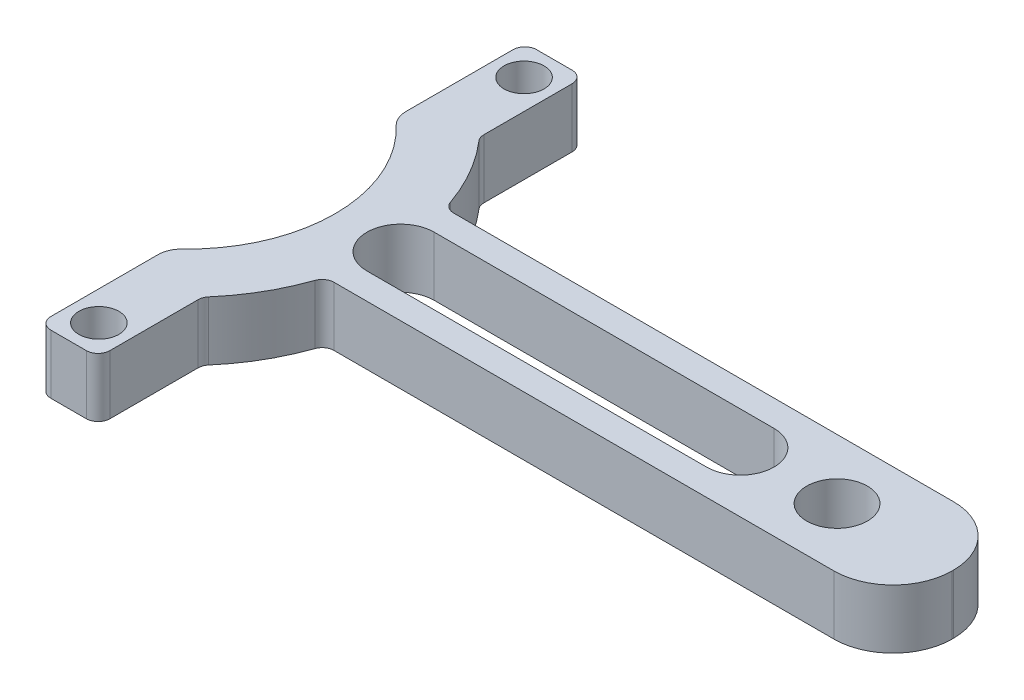
ISO-10303-21;
HEADER;
FILE_DESCRIPTION(('STEP AP214'),'2;1');
FILE_NAME('part.step','',(''),(''),'','','');
FILE_SCHEMA(('AUTOMOTIVE_DESIGN { 1 0 10303 214 1 1 1 1 }'));
ENDSEC;
DATA;
#1=APPLICATION_CONTEXT('core data for automotive mechanical design processes');
#2=APPLICATION_PROTOCOL_DEFINITION('international standard','automotive_design',2000,#1);
#3=PRODUCT_CONTEXT('',#1,'mechanical');
#4=PRODUCT('Part','Part','',(#3));
#5=PRODUCT_RELATED_PRODUCT_CATEGORY('part','',(#4));
#6=PRODUCT_DEFINITION_FORMATION('','',#4);
#7=PRODUCT_DEFINITION_CONTEXT('part definition',#1,'design');
#8=PRODUCT_DEFINITION('design','',#6,#7);
#9=PRODUCT_DEFINITION_SHAPE('','',#8);
#10=(LENGTH_UNIT() NAMED_UNIT(*) SI_UNIT(.MILLI.,.METRE.));
#11=(NAMED_UNIT(*) PLANE_ANGLE_UNIT() SI_UNIT($,.RADIAN.));
#12=(NAMED_UNIT(*) SI_UNIT($,.STERADIAN.) SOLID_ANGLE_UNIT());
#13=UNCERTAINTY_MEASURE_WITH_UNIT(LENGTH_MEASURE(1.E-05),#10,'distance_accuracy_value','');
#14=(GEOMETRIC_REPRESENTATION_CONTEXT(3) GLOBAL_UNCERTAINTY_ASSIGNED_CONTEXT((#13)) GLOBAL_UNIT_ASSIGNED_CONTEXT((#10,
#11,#12)) REPRESENTATION_CONTEXT('',''));
#15=CARTESIAN_POINT('',(0.,0.,0.));
#16=DIRECTION('',(0.,0.,1.));
#17=DIRECTION('',(1.,0.,0.));
#18=AXIS2_PLACEMENT_3D('',#15,#16,#17);
#19=CARTESIAN_POINT('',(0.,6.35,0.));
#20=DIRECTION('',(0.,-1.,0.));
#21=DIRECTION('',(0.,0.,-1.));
#22=AXIS2_PLACEMENT_3D('',#19,#20,#21);
#23=CYLINDRICAL_SURFACE('',#22,22.225);
#24=CARTESIAN_POINT('',(0.,0.,0.));
#25=DIRECTION('',(0.,1.,0.));
#26=DIRECTION('',(0.,0.,1.));
#27=AXIS2_PLACEMENT_3D('',#24,#25,#26);
#28=CIRCLE('',#27,22.225);
#29=CARTESIAN_POINT('',(16.8189189189189,0.,14.528406361292));
#30=VERTEX_POINT('',#29);
#31=CARTESIAN_POINT('',(20.9946279972448,0.,7.29220270270271));
#32=VERTEX_POINT('',#31);
#33=EDGE_CURVE('E395',#30,#32,#28,.T.);
#34=ORIENTED_EDGE('',*,*,#33,.T.);
#35=DIRECTION('',(0.,-1.,0.));
#36=VECTOR('',#35,1.);
#37=CARTESIAN_POINT('',(20.9946279972448,6.35,7.29220270270271));
#38=LINE('',#37,#36);
#39=CARTESIAN_POINT('',(20.9946279972448,6.35,7.29220270270271));
#40=VERTEX_POINT('',#39);
#41=EDGE_CURVE('E438',#32,#40,#38,.F.);
#42=ORIENTED_EDGE('',*,*,#41,.T.);
#43=CARTESIAN_POINT('',(0.,6.35,0.));
#44=DIRECTION('',(0.,1.,0.));
#45=DIRECTION('',(0.,0.,1.));
#46=AXIS2_PLACEMENT_3D('',#43,#44,#45);
#47=CIRCLE('',#46,22.225);
#48=CARTESIAN_POINT('',(16.8189189189189,6.35,14.528406361292));
#49=VERTEX_POINT('',#48);
#50=EDGE_CURVE('E404',#49,#40,#47,.T.);
#51=ORIENTED_EDGE('',*,*,#50,.F.);
#52=DIRECTION('',(0.,-1.,0.));
#53=VECTOR('',#52,1.);
#54=CARTESIAN_POINT('',(16.8189189189189,6.35,14.528406361292));
#55=LINE('',#54,#53);
#56=EDGE_CURVE('E435',#49,#30,#55,.T.);
#57=ORIENTED_EDGE('',*,*,#56,.T.);
#58=EDGE_LOOP('',(#34,#42,#51,#57));
#59=FACE_BOUND('',#58,.T.);
#60=ADVANCED_FACE('F39',(#59),#23,.T.);
#61=CARTESIAN_POINT('',(0.,6.35,0.));
#62=DIRECTION('',(0.,1.,0.));
#63=DIRECTION('',(0.,0.,1.));
#64=AXIS2_PLACEMENT_3D('',#61,#62,#63);
#65=PLANE('',#64);
#66=CARTESIAN_POINT('',(59.4458169969366,6.35,0.));
#67=DIRECTION('',(0.,1.,0.));
#68=DIRECTION('',(0.,0.,1.));
#69=AXIS2_PLACEMENT_3D('',#66,#67,#68);
#70=CIRCLE('',#69,3.61547124110945);
#71=CARTESIAN_POINT('',(59.4458169969366,6.35,3.61547124110945));
#72=VERTEX_POINT('',#71);
#73=CARTESIAN_POINT('',(59.4458169969366,6.35,-3.61547124110945));
#74=VERTEX_POINT('',#73);
#75=EDGE_CURVE('E55',#72,#74,#70,.T.);
#76=ORIENTED_EDGE('',*,*,#75,.F.);
#77=DIRECTION('',(1.,0.,0.));
#78=VECTOR('',#77,1.);
#79=CARTESIAN_POINT('',(59.4458169969366,6.35,3.61547124110945));
#80=LINE('',#79,#78);
#81=CARTESIAN_POINT('',(22.9161607893296,6.35,3.61547124110945));
#82=VERTEX_POINT('',#81);
#83=EDGE_CURVE('E245',#82,#72,#80,.T.);
#84=ORIENTED_EDGE('',*,*,#83,.F.);
#85=CARTESIAN_POINT('',(22.9161607893296,6.35,0.));
#86=DIRECTION('',(0.,1.,0.));
#87=DIRECTION('',(0.,0.,1.));
#88=AXIS2_PLACEMENT_3D('',#85,#86,#87);
#89=CIRCLE('',#88,3.61547124110945);
#90=CARTESIAN_POINT('',(22.9161607893296,6.35,-3.61547124110945));
#91=VERTEX_POINT('',#90);
#92=EDGE_CURVE('E249',#91,#82,#89,.T.);
#93=ORIENTED_EDGE('',*,*,#92,.F.);
#94=DIRECTION('',(-1.,0.,0.));
#95=VECTOR('',#94,1.);
#96=CARTESIAN_POINT('',(59.4458169969366,6.35,-3.61547124110945));
#97=LINE('',#96,#95);
#98=EDGE_CURVE('E258',#74,#91,#97,.T.);
#99=ORIENTED_EDGE('',*,*,#98,.F.);
#100=EDGE_LOOP('',(#76,#84,#93,#99));
#101=FACE_BOUND('',#100,.T.);
#102=DIRECTION('',(-1.,0.,0.));
#103=VECTOR('',#102,1.);
#104=CARTESIAN_POINT('',(10.16,6.35,26.1167656686672));
#105=LINE('',#104,#103);
#106=CARTESIAN_POINT('',(15.24,6.35,26.1167656686672));
#107=VERTEX_POINT('',#106);
#108=CARTESIAN_POINT('',(11.43,6.35,26.1167656686672));
#109=VERTEX_POINT('',#108);
#110=EDGE_CURVE('E277',#107,#109,#105,.T.);
#111=ORIENTED_EDGE('',*,*,#110,.F.);
#112=CARTESIAN_POINT('',(15.24,6.35,24.8467656686672));
#113=DIRECTION('',(0.,1.,0.));
#114=DIRECTION('',(0.,0.,1.));
#115=AXIS2_PLACEMENT_3D('',#112,#113,#114);
#116=CIRCLE('',#115,1.27);
#117=CARTESIAN_POINT('',(16.51,6.35,24.8467656686672));
#118=VERTEX_POINT('',#117);
#119=EDGE_CURVE('E486',#107,#118,#116,.T.);
#120=ORIENTED_EDGE('',*,*,#119,.T.);
#121=DIRECTION('',(0.,0.,1.));
#122=VECTOR('',#121,1.);
#123=CARTESIAN_POINT('',(16.51,6.35,26.1167656686672));
#124=LINE('',#123,#122);
#125=CARTESIAN_POINT('',(16.51,6.35,15.3586010105087));
#126=VERTEX_POINT('',#125);
#127=EDGE_CURVE('E286',#126,#118,#124,.T.);
#128=ORIENTED_EDGE('',*,*,#127,.F.);
#129=CARTESIAN_POINT('',(17.78,6.35,15.3586010105087));
#130=DIRECTION('',(0.,1.,0.));
#131=DIRECTION('',(0.,0.,1.));
#132=AXIS2_PLACEMENT_3D('',#129,#130,#131);
#133=CIRCLE('',#132,1.27);
#134=EDGE_CURVE('E48',#126,#49,#133,.F.);
#135=ORIENTED_EDGE('',*,*,#134,.T.);
#136=ORIENTED_EDGE('',*,*,#50,.T.);
#137=CARTESIAN_POINT('',(22.1943210256588,6.35,7.70890000000001));
#138=DIRECTION('',(0.,1.,0.));
#139=DIRECTION('',(0.,0.,1.));
#140=AXIS2_PLACEMENT_3D('',#137,#138,#139);
#141=CIRCLE('',#140,1.27);
#142=CARTESIAN_POINT('',(22.1943210256588,6.35,6.43890000000001));
#143=VERTEX_POINT('',#142);
#144=EDGE_CURVE('E515',#40,#143,#141,.F.);
#145=ORIENTED_EDGE('',*,*,#144,.T.);
#146=DIRECTION('',(1.,0.,0.));
#147=VECTOR('',#146,1.);
#148=CARTESIAN_POINT('',(75.953359527305,6.35,6.4389));
#149=LINE('',#148,#147);
#150=CARTESIAN_POINT('',(75.953359527305,6.35,6.4389));
#151=VERTEX_POINT('',#150);
#152=EDGE_CURVE('E338',#143,#151,#149,.T.);
#153=ORIENTED_EDGE('',*,*,#152,.T.);
#154=CARTESIAN_POINT('',(75.953359527305,6.35,0.0889000000000011));
#155=DIRECTION('',(0.,1.,0.));
#156=DIRECTION('',(0.,0.,-1.));
#157=AXIS2_PLACEMENT_3D('',#154,#155,#156);
#158=CIRCLE('',#157,6.35);
#159=CARTESIAN_POINT('',(82.303359527305,6.35,0.0889));
#160=VERTEX_POINT('',#159);
#161=EDGE_CURVE('E362',#151,#160,#158,.T.);
#162=ORIENTED_EDGE('',*,*,#161,.T.);
#163=DIRECTION('',(0.,0.,-1.));
#164=VECTOR('',#163,1.);
#165=CARTESIAN_POINT('',(82.303359527305,6.35,0.0889));
#166=LINE('',#165,#164);
#167=CARTESIAN_POINT('',(82.303359527305,6.35,-0.0888999999999993));
#168=VERTEX_POINT('',#167);
#169=EDGE_CURVE('E366',#160,#168,#166,.T.);
#170=ORIENTED_EDGE('',*,*,#169,.T.);
#171=CARTESIAN_POINT('',(75.953359527305,6.35,-0.0889000000000011));
#172=DIRECTION('',(0.,1.,0.));
#173=DIRECTION('',(0.,0.,1.));
#174=AXIS2_PLACEMENT_3D('',#171,#172,#173);
#175=CIRCLE('',#174,6.35);
#176=CARTESIAN_POINT('',(75.953359527305,6.35,-6.4389));
#177=VERTEX_POINT('',#176);
#178=EDGE_CURVE('E370',#168,#177,#175,.T.);
#179=ORIENTED_EDGE('',*,*,#178,.T.);
#180=DIRECTION('',(-1.,0.,0.));
#181=VECTOR('',#180,1.);
#182=CARTESIAN_POINT('',(38.5188395273051,6.35,-6.43890000000001));
#183=LINE('',#182,#181);
#184=CARTESIAN_POINT('',(22.1943210256588,6.35,-6.43890000000001));
#185=VERTEX_POINT('',#184);
#186=EDGE_CURVE('E343',#177,#185,#183,.T.);
#187=ORIENTED_EDGE('',*,*,#186,.T.);
#188=CARTESIAN_POINT('',(22.1943210256588,6.35,-7.70890000000001));
#189=DIRECTION('',(0.,1.,0.));
#190=DIRECTION('',(0.,0.,1.));
#191=AXIS2_PLACEMENT_3D('',#188,#189,#190);
#192=CIRCLE('',#191,1.27);
#193=CARTESIAN_POINT('',(20.9946279972448,6.35,-7.29220270270271));
#194=VERTEX_POINT('',#193);
#195=EDGE_CURVE('E524',#185,#194,#192,.F.);
#196=ORIENTED_EDGE('',*,*,#195,.T.);
#197=CARTESIAN_POINT('',(16.8189189189189,6.35,-14.528406361292));
#198=VERTEX_POINT('',#197);
#199=EDGE_CURVE('E399',#194,#198,#47,.T.);
#200=ORIENTED_EDGE('',*,*,#199,.T.);
#201=CARTESIAN_POINT('',(17.78,6.35,-15.3586010105087));
#202=DIRECTION('',(0.,1.,0.));
#203=DIRECTION('',(0.,0.,1.));
#204=AXIS2_PLACEMENT_3D('',#201,#202,#203);
#205=CIRCLE('',#204,1.27);
#206=CARTESIAN_POINT('',(16.51,6.35,-15.3586010105087));
#207=VERTEX_POINT('',#206);
#208=EDGE_CURVE('E527',#198,#207,#205,.F.);
#209=ORIENTED_EDGE('',*,*,#208,.T.);
#210=DIRECTION('',(0.,0.,-1.));
#211=VECTOR('',#210,1.);
#212=CARTESIAN_POINT('',(16.51,6.35,-26.1167656686672));
#213=LINE('',#212,#211);
#214=CARTESIAN_POINT('',(16.51,6.35,-24.8467656686672));
#215=VERTEX_POINT('',#214);
#216=EDGE_CURVE('E301',#207,#215,#213,.T.);
#217=ORIENTED_EDGE('',*,*,#216,.T.);
#218=CARTESIAN_POINT('',(15.24,6.35,-24.8467656686672));
#219=DIRECTION('',(0.,1.,0.));
#220=DIRECTION('',(0.,0.,1.));
#221=AXIS2_PLACEMENT_3D('',#218,#219,#220);
#222=CIRCLE('',#221,1.27);
#223=CARTESIAN_POINT('',(15.24,6.35,-26.1167656686672));
#224=VERTEX_POINT('',#223);
#225=EDGE_CURVE('E480',#215,#224,#222,.T.);
#226=ORIENTED_EDGE('',*,*,#225,.T.);
#227=DIRECTION('',(-1.,0.,0.));
#228=VECTOR('',#227,1.);
#229=CARTESIAN_POINT('',(10.16,6.35,-26.1167656686672));
#230=LINE('',#229,#228);
#231=CARTESIAN_POINT('',(11.43,6.35,-26.1167656686672));
#232=VERTEX_POINT('',#231);
#233=EDGE_CURVE('E310',#224,#232,#230,.T.);
#234=ORIENTED_EDGE('',*,*,#233,.T.);
#235=CARTESIAN_POINT('',(11.43,6.35,-24.8467656686672));
#236=DIRECTION('',(0.,1.,0.));
#237=DIRECTION('',(0.,0.,1.));
#238=AXIS2_PLACEMENT_3D('',#235,#236,#237);
#239=CIRCLE('',#238,1.27);
#240=CARTESIAN_POINT('',(10.16,6.35,-24.8467656686672));
#241=VERTEX_POINT('',#240);
#242=EDGE_CURVE('E477',#232,#241,#239,.T.);
#243=ORIENTED_EDGE('',*,*,#242,.T.);
#244=DIRECTION('',(0.,0.,-1.));
#245=VECTOR('',#244,1.);
#246=CARTESIAN_POINT('',(10.16,6.35,42.2389387108255));
#247=LINE('',#246,#245);
#248=CARTESIAN_POINT('',(10.16,6.35,-13.335));
#249=VERTEX_POINT('',#248);
#250=EDGE_CURVE('E314',#249,#241,#247,.T.);
#251=ORIENTED_EDGE('',*,*,#250,.F.);
#252=CARTESIAN_POINT('',(12.7,6.35,-13.335));
#253=DIRECTION('',(0.,1.,0.));
#254=DIRECTION('',(0.,0.,1.));
#255=AXIS2_PLACEMENT_3D('',#252,#253,#254);
#256=CIRCLE('',#255,2.54);
#257=CARTESIAN_POINT('',(10.948275862069,6.35,-11.4956896551724));
#258=VERTEX_POINT('',#257);
#259=EDGE_CURVE('E424',#249,#258,#256,.T.);
#260=ORIENTED_EDGE('',*,*,#259,.T.);
#261=CARTESIAN_POINT('',(0.,6.35,0.));
#262=DIRECTION('',(0.,1.,0.));
#263=DIRECTION('',(0.,0.,1.));
#264=AXIS2_PLACEMENT_3D('',#261,#262,#263);
#265=CIRCLE('',#264,15.875);
#266=CARTESIAN_POINT('',(10.948275862069,6.35,11.4956896551724));
#267=VERTEX_POINT('',#266);
#268=EDGE_CURVE('E391',#267,#258,#265,.T.);
#269=ORIENTED_EDGE('',*,*,#268,.F.);
#270=CARTESIAN_POINT('',(12.7,6.35,13.335));
#271=DIRECTION('',(0.,1.,0.));
#272=DIRECTION('',(0.,0.,1.));
#273=AXIS2_PLACEMENT_3D('',#270,#271,#272);
#274=CIRCLE('',#273,2.54);
#275=CARTESIAN_POINT('',(10.16,6.35,13.335));
#276=VERTEX_POINT('',#275);
#277=EDGE_CURVE('E427',#267,#276,#274,.T.);
#278=ORIENTED_EDGE('',*,*,#277,.T.);
#279=CARTESIAN_POINT('',(10.16,6.35,24.8467656686672));
#280=VERTEX_POINT('',#279);
#281=EDGE_CURVE('E326',#280,#276,#247,.T.);
#282=ORIENTED_EDGE('',*,*,#281,.F.);
#283=CARTESIAN_POINT('',(11.43,6.35,24.8467656686672));
#284=DIRECTION('',(0.,1.,0.));
#285=DIRECTION('',(0.,0.,1.));
#286=AXIS2_PLACEMENT_3D('',#283,#284,#285);
#287=CIRCLE('',#286,1.27);
#288=EDGE_CURVE('E483',#280,#109,#287,.T.);
#289=ORIENTED_EDGE('',*,*,#288,.T.);
#290=EDGE_LOOP('',(#111,#120,#128,#135,#136,#145,#153,#162,#170,#179,#187,#196,#200,#209,#217,
#226,#234,#243,#251,#260,#269,#278,#282,#289));
#291=FACE_BOUND('',#290,.T.);
#292=CARTESIAN_POINT('',(69.85,6.35,0.));
#293=DIRECTION('',(0.,1.,0.));
#294=DIRECTION('',(0.,0.,1.));
#295=AXIS2_PLACEMENT_3D('',#292,#293,#294);
#296=CIRCLE('',#295,3.2639);
#297=CARTESIAN_POINT('',(69.85,6.35,3.2639));
#298=VERTEX_POINT('',#297);
#299=EDGE_CURVE('E330',#298,#298,#296,.T.);
#300=ORIENTED_EDGE('',*,*,#299,.F.);
#301=EDGE_LOOP('',(#300));
#302=FACE_BOUND('',#301,.T.);
#303=CARTESIAN_POINT('',(13.335,6.35,-22.86));
#304=DIRECTION('',(0.,1.,0.));
#305=DIRECTION('',(0.,0.,1.));
#306=AXIS2_PLACEMENT_3D('',#303,#304,#305);
#307=CIRCLE('',#306,2.15265);
#308=CARTESIAN_POINT('',(13.335,6.35,-20.70735));
#309=VERTEX_POINT('',#308);
#310=EDGE_CURVE('E290',#309,#309,#307,.T.);
#311=ORIENTED_EDGE('',*,*,#310,.F.);
#312=EDGE_LOOP('',(#311));
#313=FACE_BOUND('',#312,.T.);
#314=CARTESIAN_POINT('',(13.335,6.35,22.86));
#315=DIRECTION('',(0.,-1.,0.));
#316=DIRECTION('',(0.,0.,-1.));
#317=AXIS2_PLACEMENT_3D('',#314,#315,#316);
#318=CIRCLE('',#317,2.15265);
#319=CARTESIAN_POINT('',(13.335,6.35,20.70735));
#320=VERTEX_POINT('',#319);
#321=EDGE_CURVE('E267',#320,#320,#318,.T.);
#322=ORIENTED_EDGE('',*,*,#321,.T.);
#323=EDGE_LOOP('',(#322));
#324=FACE_BOUND('',#323,.T.);
#325=ADVANCED_FACE('F538',(#101,#291,#302,#313,#324),#65,.T.);
#326=CARTESIAN_POINT('',(0.,0.,0.));
#327=DIRECTION('',(0.,1.,0.));
#328=DIRECTION('',(0.,0.,1.));
#329=AXIS2_PLACEMENT_3D('',#326,#327,#328);
#330=PLANE('',#329);
#331=DIRECTION('',(1.,0.,0.));
#332=VECTOR('',#331,1.);
#333=CARTESIAN_POINT('',(59.4458169969366,0.,3.61547124110945));
#334=LINE('',#333,#332);
#335=CARTESIAN_POINT('',(22.9161607893296,0.,3.61547124110945));
#336=VERTEX_POINT('',#335);
#337=CARTESIAN_POINT('',(59.4458169969366,0.,3.61547124110945));
#338=VERTEX_POINT('',#337);
#339=EDGE_CURVE('E233',#336,#338,#334,.T.);
#340=ORIENTED_EDGE('',*,*,#339,.T.);
#341=CARTESIAN_POINT('',(59.4458169969366,0.,0.));
#342=DIRECTION('',(0.,1.,0.));
#343=DIRECTION('',(0.,0.,1.));
#344=AXIS2_PLACEMENT_3D('',#341,#342,#343);
#345=CIRCLE('',#344,3.61547124110945);
#346=CARTESIAN_POINT('',(59.4458169969366,0.,-3.61547124110945));
#347=VERTEX_POINT('',#346);
#348=EDGE_CURVE('E226',#338,#347,#345,.T.);
#349=ORIENTED_EDGE('',*,*,#348,.T.);
#350=DIRECTION('',(-1.,0.,0.));
#351=VECTOR('',#350,1.);
#352=CARTESIAN_POINT('',(59.4458169969366,0.,-3.61547124110945));
#353=LINE('',#352,#351);
#354=CARTESIAN_POINT('',(22.9161607893296,0.,-3.61547124110945));
#355=VERTEX_POINT('',#354);
#356=EDGE_CURVE('E236',#347,#355,#353,.T.);
#357=ORIENTED_EDGE('',*,*,#356,.T.);
#358=CARTESIAN_POINT('',(22.9161607893296,0.,0.));
#359=DIRECTION('',(0.,1.,0.));
#360=DIRECTION('',(0.,0.,1.));
#361=AXIS2_PLACEMENT_3D('',#358,#359,#360);
#362=CIRCLE('',#361,3.61547124110945);
#363=EDGE_CURVE('E63',#355,#336,#362,.T.);
#364=ORIENTED_EDGE('',*,*,#363,.T.);
#365=EDGE_LOOP('',(#340,#349,#357,#364));
#366=FACE_BOUND('',#365,.T.);
#367=DIRECTION('',(0.,0.,1.));
#368=VECTOR('',#367,1.);
#369=CARTESIAN_POINT('',(16.51,0.,26.1167656686672));
#370=LINE('',#369,#368);
#371=CARTESIAN_POINT('',(16.51,0.,15.3586010105087));
#372=VERTEX_POINT('',#371);
#373=CARTESIAN_POINT('',(16.51,0.,24.8467656686672));
#374=VERTEX_POINT('',#373);
#375=EDGE_CURVE('E285',#372,#374,#370,.T.);
#376=ORIENTED_EDGE('',*,*,#375,.T.);
#377=CARTESIAN_POINT('',(15.24,0.,24.8467656686672));
#378=DIRECTION('',(0.,1.,0.));
#379=DIRECTION('',(0.,0.,1.));
#380=AXIS2_PLACEMENT_3D('',#377,#378,#379);
#381=CIRCLE('',#380,1.27);
#382=CARTESIAN_POINT('',(15.24,0.,26.1167656686672));
#383=VERTEX_POINT('',#382);
#384=EDGE_CURVE('E498',#374,#383,#381,.F.);
#385=ORIENTED_EDGE('',*,*,#384,.T.);
#386=DIRECTION('',(-1.,0.,0.));
#387=VECTOR('',#386,1.);
#388=CARTESIAN_POINT('',(10.16,0.,26.1167656686672));
#389=LINE('',#388,#387);
#390=CARTESIAN_POINT('',(11.43,0.,26.1167656686672));
#391=VERTEX_POINT('',#390);
#392=EDGE_CURVE('E281',#383,#391,#389,.T.);
#393=ORIENTED_EDGE('',*,*,#392,.T.);
#394=CARTESIAN_POINT('',(11.43,0.,24.8467656686672));
#395=DIRECTION('',(0.,1.,0.));
#396=DIRECTION('',(0.,0.,1.));
#397=AXIS2_PLACEMENT_3D('',#394,#395,#396);
#398=CIRCLE('',#397,1.27);
#399=CARTESIAN_POINT('',(10.16,0.,24.8467656686672));
#400=VERTEX_POINT('',#399);
#401=EDGE_CURVE('E495',#391,#400,#398,.F.);
#402=ORIENTED_EDGE('',*,*,#401,.T.);
#403=DIRECTION('',(0.,0.,-1.));
#404=VECTOR('',#403,1.);
#405=CARTESIAN_POINT('',(10.16,0.,42.2389387108255));
#406=LINE('',#405,#404);
#407=CARTESIAN_POINT('',(10.16,0.,13.335));
#408=VERTEX_POINT('',#407);
#409=EDGE_CURVE('E325',#400,#408,#406,.T.);
#410=ORIENTED_EDGE('',*,*,#409,.T.);
#411=CARTESIAN_POINT('',(12.7,0.,13.335));
#412=DIRECTION('',(0.,1.,0.));
#413=DIRECTION('',(0.,0.,1.));
#414=AXIS2_PLACEMENT_3D('',#411,#412,#413);
#415=CIRCLE('',#414,2.54);
#416=CARTESIAN_POINT('',(10.948275862069,0.,11.4956896551724));
#417=VERTEX_POINT('',#416);
#418=EDGE_CURVE('E415',#408,#417,#415,.F.);
#419=ORIENTED_EDGE('',*,*,#418,.T.);
#420=CARTESIAN_POINT('',(0.,0.,0.));
#421=DIRECTION('',(0.,1.,0.));
#422=DIRECTION('',(0.,0.,1.));
#423=AXIS2_PLACEMENT_3D('',#420,#421,#422);
#424=CIRCLE('',#423,15.875);
#425=CARTESIAN_POINT('',(10.948275862069,0.,-11.4956896551724));
#426=VERTEX_POINT('',#425);
#427=EDGE_CURVE('E381',#417,#426,#424,.T.);
#428=ORIENTED_EDGE('',*,*,#427,.T.);
#429=CARTESIAN_POINT('',(12.7,0.,-13.335));
#430=DIRECTION('',(0.,1.,0.));
#431=DIRECTION('',(0.,0.,1.));
#432=AXIS2_PLACEMENT_3D('',#429,#430,#431);
#433=CIRCLE('',#432,2.54);
#434=CARTESIAN_POINT('',(10.16,0.,-13.335));
#435=VERTEX_POINT('',#434);
#436=EDGE_CURVE('E412',#426,#435,#433,.F.);
#437=ORIENTED_EDGE('',*,*,#436,.T.);
#438=CARTESIAN_POINT('',(10.16,0.,-24.8467656686672));
#439=VERTEX_POINT('',#438);
#440=EDGE_CURVE('E321',#435,#439,#406,.T.);
#441=ORIENTED_EDGE('',*,*,#440,.T.);
#442=CARTESIAN_POINT('',(11.43,0.,-24.8467656686672));
#443=DIRECTION('',(0.,1.,0.));
#444=DIRECTION('',(0.,0.,1.));
#445=AXIS2_PLACEMENT_3D('',#442,#443,#444);
#446=CIRCLE('',#445,1.27);
#447=CARTESIAN_POINT('',(11.43,0.,-26.1167656686672));
#448=VERTEX_POINT('',#447);
#449=EDGE_CURVE('E489',#439,#448,#446,.F.);
#450=ORIENTED_EDGE('',*,*,#449,.T.);
#451=DIRECTION('',(-1.,0.,0.));
#452=VECTOR('',#451,1.);
#453=CARTESIAN_POINT('',(10.16,0.,-26.1167656686672));
#454=LINE('',#453,#452);
#455=CARTESIAN_POINT('',(15.24,0.,-26.1167656686672));
#456=VERTEX_POINT('',#455);
#457=EDGE_CURVE('E309',#456,#448,#454,.T.);
#458=ORIENTED_EDGE('',*,*,#457,.F.);
#459=CARTESIAN_POINT('',(15.24,0.,-24.8467656686672));
#460=DIRECTION('',(0.,1.,0.));
#461=DIRECTION('',(0.,0.,1.));
#462=AXIS2_PLACEMENT_3D('',#459,#460,#461);
#463=CIRCLE('',#462,1.27);
#464=CARTESIAN_POINT('',(16.51,0.,-24.8467656686672));
#465=VERTEX_POINT('',#464);
#466=EDGE_CURVE('E492',#456,#465,#463,.F.);
#467=ORIENTED_EDGE('',*,*,#466,.T.);
#468=DIRECTION('',(0.,0.,-1.));
#469=VECTOR('',#468,1.);
#470=CARTESIAN_POINT('',(16.51,0.,-26.1167656686672));
#471=LINE('',#470,#469);
#472=CARTESIAN_POINT('',(16.51,0.,-15.3586010105087));
#473=VERTEX_POINT('',#472);
#474=EDGE_CURVE('E305',#473,#465,#471,.T.);
#475=ORIENTED_EDGE('',*,*,#474,.F.);
#476=CARTESIAN_POINT('',(17.78,0.,-15.3586010105087));
#477=DIRECTION('',(0.,1.,0.));
#478=DIRECTION('',(0.,0.,1.));
#479=AXIS2_PLACEMENT_3D('',#476,#477,#478);
#480=CIRCLE('',#479,1.27);
#481=CARTESIAN_POINT('',(16.8189189189189,0.,-14.528406361292));
#482=VERTEX_POINT('',#481);
#483=EDGE_CURVE('E530',#473,#482,#480,.T.);
#484=ORIENTED_EDGE('',*,*,#483,.T.);
#485=CARTESIAN_POINT('',(20.9946279972448,0.,-7.29220270270271));
#486=VERTEX_POINT('',#485);
#487=EDGE_CURVE('E405',#486,#482,#28,.T.);
#488=ORIENTED_EDGE('',*,*,#487,.F.);
#489=CARTESIAN_POINT('',(22.1943210256588,0.,-7.70890000000001));
#490=DIRECTION('',(0.,1.,0.));
#491=DIRECTION('',(0.,0.,1.));
#492=AXIS2_PLACEMENT_3D('',#489,#490,#491);
#493=CIRCLE('',#492,1.27);
#494=CARTESIAN_POINT('',(22.1943210256588,0.,-6.43890000000001));
#495=VERTEX_POINT('',#494);
#496=EDGE_CURVE('E521',#486,#495,#493,.T.);
#497=ORIENTED_EDGE('',*,*,#496,.T.);
#498=DIRECTION('',(-1.,0.,0.));
#499=VECTOR('',#498,1.);
#500=CARTESIAN_POINT('',(75.953359527305,0.,-6.4389));
#501=LINE('',#500,#499);
#502=CARTESIAN_POINT('',(75.953359527305,0.,-6.4389));
#503=VERTEX_POINT('',#502);
#504=EDGE_CURVE('E355',#503,#495,#501,.T.);
#505=ORIENTED_EDGE('',*,*,#504,.F.);
#506=CARTESIAN_POINT('',(75.953359527305,0.,-0.0889000000000011));
#507=DIRECTION('',(0.,1.,0.));
#508=DIRECTION('',(0.,0.,1.));
#509=AXIS2_PLACEMENT_3D('',#506,#507,#508);
#510=CIRCLE('',#509,6.35);
#511=CARTESIAN_POINT('',(82.303359527305,0.,-0.0888999999999993));
#512=VERTEX_POINT('',#511);
#513=EDGE_CURVE('E351',#512,#503,#510,.T.);
#514=ORIENTED_EDGE('',*,*,#513,.F.);
#515=DIRECTION('',(0.,0.,-1.));
#516=VECTOR('',#515,1.);
#517=CARTESIAN_POINT('',(82.303359527305,0.,0.0889));
#518=LINE('',#517,#516);
#519=CARTESIAN_POINT('',(82.303359527305,0.,0.0889));
#520=VERTEX_POINT('',#519);
#521=EDGE_CURVE('E347',#520,#512,#518,.T.);
#522=ORIENTED_EDGE('',*,*,#521,.F.);
#523=CARTESIAN_POINT('',(75.953359527305,0.,0.0889000000000011));
#524=DIRECTION('',(0.,1.,0.));
#525=DIRECTION('',(0.,0.,-1.));
#526=AXIS2_PLACEMENT_3D('',#523,#524,#525);
#527=CIRCLE('',#526,6.35);
#528=CARTESIAN_POINT('',(75.953359527305,0.,6.4389));
#529=VERTEX_POINT('',#528);
#530=EDGE_CURVE('E342',#529,#520,#527,.T.);
#531=ORIENTED_EDGE('',*,*,#530,.F.);
#532=DIRECTION('',(1.,0.,0.));
#533=VECTOR('',#532,1.);
#534=CARTESIAN_POINT('',(38.5188395273051,0.,6.43890000000001));
#535=LINE('',#534,#533);
#536=CARTESIAN_POINT('',(22.1943210256588,0.,6.43890000000001));
#537=VERTEX_POINT('',#536);
#538=EDGE_CURVE('E339',#537,#529,#535,.T.);
#539=ORIENTED_EDGE('',*,*,#538,.F.);
#540=CARTESIAN_POINT('',(22.1943210256588,0.,7.70890000000001));
#541=DIRECTION('',(0.,1.,0.));
#542=DIRECTION('',(0.,0.,1.));
#543=AXIS2_PLACEMENT_3D('',#540,#541,#542);
#544=CIRCLE('',#543,1.27);
#545=EDGE_CURVE('E518',#537,#32,#544,.T.);
#546=ORIENTED_EDGE('',*,*,#545,.T.);
#547=ORIENTED_EDGE('',*,*,#33,.F.);
#548=CARTESIAN_POINT('',(17.78,0.,15.3586010105087));
#549=DIRECTION('',(0.,1.,0.));
#550=DIRECTION('',(0.,0.,1.));
#551=AXIS2_PLACEMENT_3D('',#548,#549,#550);
#552=CIRCLE('',#551,1.27);
#553=EDGE_CURVE('E11',#30,#372,#552,.T.);
#554=ORIENTED_EDGE('',*,*,#553,.T.);
#555=EDGE_LOOP('',(#376,#385,#393,#402,#410,#419,#428,#437,#441,#450,#458,#467,#475,#484,#488,
#497,#505,#514,#522,#531,#539,#546,#547,#554));
#556=FACE_BOUND('',#555,.T.);
#557=CARTESIAN_POINT('',(13.335,0.,-22.86));
#558=DIRECTION('',(0.,1.,0.));
#559=DIRECTION('',(0.,0.,1.));
#560=AXIS2_PLACEMENT_3D('',#557,#558,#559);
#561=CIRCLE('',#560,2.15265);
#562=CARTESIAN_POINT('',(13.335,0.,-20.70735));
#563=VERTEX_POINT('',#562);
#564=EDGE_CURVE('E297',#563,#563,#561,.T.);
#565=ORIENTED_EDGE('',*,*,#564,.T.);
#566=EDGE_LOOP('',(#565));
#567=FACE_BOUND('',#566,.T.);
#568=CARTESIAN_POINT('',(69.85,0.,0.));
#569=DIRECTION('',(0.,1.,0.));
#570=DIRECTION('',(0.,0.,1.));
#571=AXIS2_PLACEMENT_3D('',#568,#569,#570);
#572=CIRCLE('',#571,3.2639);
#573=CARTESIAN_POINT('',(69.85,0.,3.2639));
#574=VERTEX_POINT('',#573);
#575=EDGE_CURVE('E334',#574,#574,#572,.T.);
#576=ORIENTED_EDGE('',*,*,#575,.T.);
#577=EDGE_LOOP('',(#576));
#578=FACE_BOUND('',#577,.T.);
#579=CARTESIAN_POINT('',(13.335,0.,22.86));
#580=DIRECTION('',(0.,-1.,0.));
#581=DIRECTION('',(0.,0.,-1.));
#582=AXIS2_PLACEMENT_3D('',#579,#580,#581);
#583=CIRCLE('',#582,2.15265);
#584=CARTESIAN_POINT('',(13.335,0.,20.70735));
#585=VERTEX_POINT('',#584);
#586=EDGE_CURVE('E273',#585,#585,#583,.T.);
#587=ORIENTED_EDGE('',*,*,#586,.F.);
#588=EDGE_LOOP('',(#587));
#589=FACE_BOUND('',#588,.T.);
#590=ADVANCED_FACE('F241',(#366,#556,#567,#578,#589),#330,.F.);
#591=ORIENTED_EDGE('',*,*,#199,.F.);
#592=DIRECTION('',(0.,-1.,0.));
#593=VECTOR('',#592,1.);
#594=CARTESIAN_POINT('',(20.9946279972448,6.35,-7.29220270270271));
#595=LINE('',#594,#593);
#596=EDGE_CURVE('E449',#194,#486,#595,.T.);
#597=ORIENTED_EDGE('',*,*,#596,.T.);
#598=ORIENTED_EDGE('',*,*,#487,.T.);
#599=DIRECTION('',(0.,-1.,0.));
#600=VECTOR('',#599,1.);
#601=CARTESIAN_POINT('',(16.8189189189189,6.35,-14.528406361292));
#602=LINE('',#601,#600);
#603=EDGE_CURVE('E445',#482,#198,#602,.F.);
#604=ORIENTED_EDGE('',*,*,#603,.T.);
#605=EDGE_LOOP('',(#591,#597,#598,#604));
#606=FACE_BOUND('',#605,.T.);
#607=ADVANCED_FACE('F617',(#606),#23,.T.);
#608=CARTESIAN_POINT('',(0.,6.35,0.));
#609=DIRECTION('',(0.,-1.,0.));
#610=DIRECTION('',(0.,0.,-1.));
#611=AXIS2_PLACEMENT_3D('',#608,#609,#610);
#612=CYLINDRICAL_SURFACE('',#611,15.875);
#613=ORIENTED_EDGE('',*,*,#427,.F.);
#614=DIRECTION('',(0.,-1.,0.));
#615=VECTOR('',#614,1.);
#616=CARTESIAN_POINT('',(10.948275862069,6.35,11.4956896551724));
#617=LINE('',#616,#615);
#618=EDGE_CURVE('E421',#417,#267,#617,.F.);
#619=ORIENTED_EDGE('',*,*,#618,.T.);
#620=ORIENTED_EDGE('',*,*,#268,.T.);
#621=DIRECTION('',(0.,-1.,0.));
#622=VECTOR('',#621,1.);
#623=CARTESIAN_POINT('',(10.948275862069,6.35,-11.4956896551724));
#624=LINE('',#623,#622);
#625=EDGE_CURVE('E418',#258,#426,#624,.T.);
#626=ORIENTED_EDGE('',*,*,#625,.T.);
#627=EDGE_LOOP('',(#613,#619,#620,#626));
#628=FACE_BOUND('',#627,.T.);
#629=ADVANCED_FACE('F583',(#628),#612,.F.);
#630=CARTESIAN_POINT('',(38.5188395273051,0.,-6.43890000000001));
#631=DIRECTION('',(0.,0.,-1.));
#632=DIRECTION('',(-1.,0.,0.));
#633=AXIS2_PLACEMENT_3D('',#630,#631,#632);
#634=PLANE('',#633);
#635=ORIENTED_EDGE('',*,*,#504,.T.);
#636=DIRECTION('',(0.,-1.,0.));
#637=VECTOR('',#636,1.);
#638=CARTESIAN_POINT('',(22.1943210256588,0.,-6.43890000000001));
#639=LINE('',#638,#637);
#640=EDGE_CURVE('E453',#495,#185,#639,.F.);
#641=ORIENTED_EDGE('',*,*,#640,.T.);
#642=ORIENTED_EDGE('',*,*,#186,.F.);
#643=DIRECTION('',(0.,1.,0.));
#644=VECTOR('',#643,1.);
#645=CARTESIAN_POINT('',(75.953359527305,0.,-6.4389));
#646=LINE('',#645,#644);
#647=EDGE_CURVE('E377',#503,#177,#646,.T.);
#648=ORIENTED_EDGE('',*,*,#647,.F.);
#649=EDGE_LOOP('',(#635,#641,#642,#648));
#650=FACE_BOUND('',#649,.T.);
#651=ADVANCED_FACE('F626',(#650),#634,.T.);
#652=CARTESIAN_POINT('',(75.953359527305,0.,6.4389));
#653=DIRECTION('',(0.,0.,1.));
#654=DIRECTION('',(1.,0.,0.));
#655=AXIS2_PLACEMENT_3D('',#652,#653,#654);
#656=PLANE('',#655);
#657=ORIENTED_EDGE('',*,*,#152,.F.);
#658=DIRECTION('',(0.,-1.,0.));
#659=VECTOR('',#658,1.);
#660=CARTESIAN_POINT('',(22.1943210256588,0.,6.43890000000001));
#661=LINE('',#660,#659);
#662=EDGE_CURVE('E442',#143,#537,#661,.T.);
#663=ORIENTED_EDGE('',*,*,#662,.T.);
#664=ORIENTED_EDGE('',*,*,#538,.T.);
#665=DIRECTION('',(0.,1.,0.));
#666=VECTOR('',#665,1.);
#667=CARTESIAN_POINT('',(75.953359527305,0.,6.4389));
#668=LINE('',#667,#666);
#669=EDGE_CURVE('E359',#529,#151,#668,.T.);
#670=ORIENTED_EDGE('',*,*,#669,.T.);
#671=EDGE_LOOP('',(#657,#663,#664,#670));
#672=FACE_BOUND('',#671,.T.);
#673=ADVANCED_FACE('F642',(#672),#656,.T.);
#674=CARTESIAN_POINT('',(75.953359527305,0.,-0.0889000000000011));
#675=DIRECTION('',(0.,1.,0.));
#676=DIRECTION('',(0.,0.,1.));
#677=AXIS2_PLACEMENT_3D('',#674,#675,#676);
#678=CYLINDRICAL_SURFACE('',#677,6.35);
#679=ORIENTED_EDGE('',*,*,#178,.F.);
#680=DIRECTION('',(0.,1.,0.));
#681=VECTOR('',#680,1.);
#682=CARTESIAN_POINT('',(82.303359527305,0.,-0.0888999999999993));
#683=LINE('',#682,#681);
#684=EDGE_CURVE('E382',#512,#168,#683,.T.);
#685=ORIENTED_EDGE('',*,*,#684,.F.);
#686=ORIENTED_EDGE('',*,*,#513,.T.);
#687=ORIENTED_EDGE('',*,*,#647,.T.);
#688=EDGE_LOOP('',(#679,#685,#686,#687));
#689=FACE_BOUND('',#688,.T.);
#690=ADVANCED_FACE('F629',(#689),#678,.T.);
#691=CARTESIAN_POINT('',(82.303359527305,0.,0.0889));
#692=DIRECTION('',(1.,0.,0.));
#693=DIRECTION('',(0.,0.,-1.));
#694=AXIS2_PLACEMENT_3D('',#691,#692,#693);
#695=PLANE('',#694);
#696=ORIENTED_EDGE('',*,*,#169,.F.);
#697=DIRECTION('',(0.,1.,0.));
#698=VECTOR('',#697,1.);
#699=CARTESIAN_POINT('',(82.303359527305,0.,0.0889));
#700=LINE('',#699,#698);
#701=EDGE_CURVE('E385',#520,#160,#700,.T.);
#702=ORIENTED_EDGE('',*,*,#701,.F.);
#703=ORIENTED_EDGE('',*,*,#521,.T.);
#704=ORIENTED_EDGE('',*,*,#684,.T.);
#705=EDGE_LOOP('',(#696,#702,#703,#704));
#706=FACE_BOUND('',#705,.T.);
#707=ADVANCED_FACE('F633',(#706),#695,.T.);
#708=CARTESIAN_POINT('',(75.953359527305,0.,0.0889000000000011));
#709=DIRECTION('',(0.,1.,0.));
#710=DIRECTION('',(0.,0.,1.));
#711=AXIS2_PLACEMENT_3D('',#708,#709,#710);
#712=CYLINDRICAL_SURFACE('',#711,6.35);
#713=ORIENTED_EDGE('',*,*,#161,.F.);
#714=ORIENTED_EDGE('',*,*,#669,.F.);
#715=ORIENTED_EDGE('',*,*,#530,.T.);
#716=ORIENTED_EDGE('',*,*,#701,.T.);
#717=EDGE_LOOP('',(#713,#714,#715,#716));
#718=FACE_BOUND('',#717,.T.);
#719=ADVANCED_FACE('F639',(#718),#712,.T.);
#720=CARTESIAN_POINT('',(69.85,6.35,0.));
#721=DIRECTION('',(0.,1.,0.));
#722=DIRECTION('',(0.,0.,1.));
#723=AXIS2_PLACEMENT_3D('',#720,#721,#722);
#724=CYLINDRICAL_SURFACE('',#723,3.2639);
#725=ORIENTED_EDGE('',*,*,#575,.F.);
#726=EDGE_LOOP('',(#725));
#727=FACE_BOUND('',#726,.T.);
#728=ORIENTED_EDGE('',*,*,#299,.T.);
#729=EDGE_LOOP('',(#728));
#730=FACE_BOUND('',#729,.T.);
#731=ADVANCED_FACE('F680',(#727,#730),#724,.F.);
#732=CARTESIAN_POINT('',(10.16,0.,42.2389387108255));
#733=DIRECTION('',(1.,0.,0.));
#734=DIRECTION('',(0.,0.,-1.));
#735=AXIS2_PLACEMENT_3D('',#732,#733,#734);
#736=PLANE('',#735);
#737=ORIENTED_EDGE('',*,*,#250,.T.);
#738=DIRECTION('',(0.,1.,0.));
#739=VECTOR('',#738,1.);
#740=CARTESIAN_POINT('',(10.16,0.,-24.8467656686672));
#741=LINE('',#740,#739);
#742=EDGE_CURVE('E512',#241,#439,#741,.F.);
#743=ORIENTED_EDGE('',*,*,#742,.T.);
#744=ORIENTED_EDGE('',*,*,#440,.F.);
#745=DIRECTION('',(0.,1.,0.));
#746=VECTOR('',#745,1.);
#747=CARTESIAN_POINT('',(10.16,6.35,-13.335));
#748=LINE('',#747,#746);
#749=EDGE_CURVE('E431',#435,#249,#748,.T.);
#750=ORIENTED_EDGE('',*,*,#749,.T.);
#751=EDGE_LOOP('',(#737,#743,#744,#750));
#752=FACE_BOUND('',#751,.T.);
#753=ADVANCED_FACE('F591',(#752),#736,.F.);
#754=ORIENTED_EDGE('',*,*,#409,.F.);
#755=DIRECTION('',(0.,1.,0.));
#756=VECTOR('',#755,1.);
#757=CARTESIAN_POINT('',(10.16,0.,24.8467656686672));
#758=LINE('',#757,#756);
#759=EDGE_CURVE('E501',#400,#280,#758,.T.);
#760=ORIENTED_EDGE('',*,*,#759,.T.);
#761=ORIENTED_EDGE('',*,*,#281,.T.);
#762=DIRECTION('',(0.,1.,0.));
#763=VECTOR('',#762,1.);
#764=CARTESIAN_POINT('',(10.16,0.,13.335));
#765=LINE('',#764,#763);
#766=EDGE_CURVE('E403',#276,#408,#765,.F.);
#767=ORIENTED_EDGE('',*,*,#766,.T.);
#768=EDGE_LOOP('',(#754,#760,#761,#767));
#769=FACE_BOUND('',#768,.T.);
#770=ADVANCED_FACE('F570',(#769),#736,.F.);
#771=CARTESIAN_POINT('',(12.7,6.35,13.335));
#772=DIRECTION('',(0.,-1.,0.));
#773=DIRECTION('',(0.,0.,-1.));
#774=AXIS2_PLACEMENT_3D('',#771,#772,#773);
#775=CYLINDRICAL_SURFACE('',#774,2.54);
#776=ORIENTED_EDGE('',*,*,#277,.F.);
#777=ORIENTED_EDGE('',*,*,#618,.F.);
#778=ORIENTED_EDGE('',*,*,#418,.F.);
#779=ORIENTED_EDGE('',*,*,#766,.F.);
#780=EDGE_LOOP('',(#776,#777,#778,#779));
#781=FACE_BOUND('',#780,.T.);
#782=ADVANCED_FACE('F579',(#781),#775,.T.);
#783=CARTESIAN_POINT('',(12.7,6.35,-13.335));
#784=DIRECTION('',(0.,-1.,0.));
#785=DIRECTION('',(0.,0.,-1.));
#786=AXIS2_PLACEMENT_3D('',#783,#784,#785);
#787=CYLINDRICAL_SURFACE('',#786,2.54);
#788=ORIENTED_EDGE('',*,*,#436,.F.);
#789=ORIENTED_EDGE('',*,*,#625,.F.);
#790=ORIENTED_EDGE('',*,*,#259,.F.);
#791=ORIENTED_EDGE('',*,*,#749,.F.);
#792=EDGE_LOOP('',(#788,#789,#790,#791));
#793=FACE_BOUND('',#792,.T.);
#794=ADVANCED_FACE('F586',(#793),#787,.T.);
#795=CARTESIAN_POINT('',(10.16,0.,-26.1167656686672));
#796=DIRECTION('',(0.,0.,-1.));
#797=DIRECTION('',(-1.,0.,0.));
#798=AXIS2_PLACEMENT_3D('',#795,#796,#797);
#799=PLANE('',#798);
#800=ORIENTED_EDGE('',*,*,#233,.F.);
#801=DIRECTION('',(0.,1.,0.));
#802=VECTOR('',#801,1.);
#803=CARTESIAN_POINT('',(15.24,0.,-26.1167656686672));
#804=LINE('',#803,#802);
#805=EDGE_CURVE('E509',#224,#456,#804,.F.);
#806=ORIENTED_EDGE('',*,*,#805,.T.);
#807=ORIENTED_EDGE('',*,*,#457,.T.);
#808=DIRECTION('',(0.,1.,0.));
#809=VECTOR('',#808,1.);
#810=CARTESIAN_POINT('',(11.43,6.35,-26.1167656686672));
#811=LINE('',#810,#809);
#812=EDGE_CURVE('E505',#448,#232,#811,.T.);
#813=ORIENTED_EDGE('',*,*,#812,.T.);
#814=EDGE_LOOP('',(#800,#806,#807,#813));
#815=FACE_BOUND('',#814,.T.);
#816=ADVANCED_FACE('F600',(#815),#799,.T.);
#817=CARTESIAN_POINT('',(16.51,0.,-26.1167656686672));
#818=DIRECTION('',(1.,0.,0.));
#819=DIRECTION('',(0.,0.,-1.));
#820=AXIS2_PLACEMENT_3D('',#817,#818,#819);
#821=PLANE('',#820);
#822=ORIENTED_EDGE('',*,*,#216,.F.);
#823=DIRECTION('',(0.,-1.,0.));
#824=VECTOR('',#823,1.);
#825=CARTESIAN_POINT('',(16.51,0.,-15.3586010105087));
#826=LINE('',#825,#824);
#827=EDGE_CURVE('E460',#207,#473,#826,.T.);
#828=ORIENTED_EDGE('',*,*,#827,.T.);
#829=ORIENTED_EDGE('',*,*,#474,.T.);
#830=DIRECTION('',(0.,1.,0.));
#831=VECTOR('',#830,1.);
#832=CARTESIAN_POINT('',(16.51,0.,-24.8467656686672));
#833=LINE('',#832,#831);
#834=EDGE_CURVE('E456',#465,#215,#833,.T.);
#835=ORIENTED_EDGE('',*,*,#834,.T.);
#836=EDGE_LOOP('',(#822,#828,#829,#835));
#837=FACE_BOUND('',#836,.T.);
#838=ADVANCED_FACE('F609',(#837),#821,.T.);
#839=CARTESIAN_POINT('',(13.335,0.,-22.86));
#840=DIRECTION('',(0.,1.,0.));
#841=DIRECTION('',(0.,0.,1.));
#842=AXIS2_PLACEMENT_3D('',#839,#840,#841);
#843=CYLINDRICAL_SURFACE('',#842,2.15265);
#844=ORIENTED_EDGE('',*,*,#564,.F.);
#845=EDGE_LOOP('',(#844));
#846=FACE_BOUND('',#845,.T.);
#847=ORIENTED_EDGE('',*,*,#310,.T.);
#848=EDGE_LOOP('',(#847));
#849=FACE_BOUND('',#848,.T.);
#850=ADVANCED_FACE('F694',(#846,#849),#843,.F.);
#851=CARTESIAN_POINT('',(16.51,0.,26.1167656686672));
#852=DIRECTION('',(-1.,0.,0.));
#853=DIRECTION('',(0.,0.,1.));
#854=AXIS2_PLACEMENT_3D('',#851,#852,#853);
#855=PLANE('',#854);
#856=ORIENTED_EDGE('',*,*,#375,.F.);
#857=DIRECTION('',(0.,1.,0.));
#858=VECTOR('',#857,1.);
#859=CARTESIAN_POINT('',(16.51,6.35,15.3586010105087));
#860=LINE('',#859,#858);
#861=EDGE_CURVE('E466',#372,#126,#860,.T.);
#862=ORIENTED_EDGE('',*,*,#861,.T.);
#863=ORIENTED_EDGE('',*,*,#127,.T.);
#864=DIRECTION('',(0.,1.,0.));
#865=VECTOR('',#864,1.);
#866=CARTESIAN_POINT('',(16.51,0.,24.8467656686672));
#867=LINE('',#866,#865);
#868=EDGE_CURVE('E463',#118,#374,#867,.F.);
#869=ORIENTED_EDGE('',*,*,#868,.T.);
#870=EDGE_LOOP('',(#856,#862,#863,#869));
#871=FACE_BOUND('',#870,.T.);
#872=ADVANCED_FACE('F554',(#871),#855,.F.);
#873=CARTESIAN_POINT('',(10.16,0.,26.1167656686672));
#874=DIRECTION('',(0.,0.,-1.));
#875=DIRECTION('',(-1.,0.,0.));
#876=AXIS2_PLACEMENT_3D('',#873,#874,#875);
#877=PLANE('',#876);
#878=ORIENTED_EDGE('',*,*,#392,.F.);
#879=DIRECTION('',(0.,1.,0.));
#880=VECTOR('',#879,1.);
#881=CARTESIAN_POINT('',(15.24,0.,26.1167656686672));
#882=LINE('',#881,#880);
#883=EDGE_CURVE('E473',#383,#107,#882,.T.);
#884=ORIENTED_EDGE('',*,*,#883,.T.);
#885=ORIENTED_EDGE('',*,*,#110,.T.);
#886=DIRECTION('',(0.,1.,0.));
#887=VECTOR('',#886,1.);
#888=CARTESIAN_POINT('',(11.43,0.,26.1167656686672));
#889=LINE('',#888,#887);
#890=EDGE_CURVE('E470',#109,#391,#889,.F.);
#891=ORIENTED_EDGE('',*,*,#890,.T.);
#892=EDGE_LOOP('',(#878,#884,#885,#891));
#893=FACE_BOUND('',#892,.T.);
#894=ADVANCED_FACE('F562',(#893),#877,.F.);
#895=CARTESIAN_POINT('',(13.335,0.,22.86));
#896=DIRECTION('',(0.,1.,0.));
#897=DIRECTION('',(0.,0.,1.));
#898=AXIS2_PLACEMENT_3D('',#895,#896,#897);
#899=CYLINDRICAL_SURFACE('',#898,2.15265);
#900=ORIENTED_EDGE('',*,*,#586,.T.);
#901=EDGE_LOOP('',(#900));
#902=FACE_BOUND('',#901,.T.);
#903=ORIENTED_EDGE('',*,*,#321,.F.);
#904=EDGE_LOOP('',(#903));
#905=FACE_BOUND('',#904,.T.);
#906=ADVANCED_FACE('F648',(#902,#905),#899,.F.);
#907=CARTESIAN_POINT('',(22.1943210256588,6.35,7.70890000000001));
#908=DIRECTION('',(0.,-1.,0.));
#909=DIRECTION('',(0.,0.,-1.));
#910=AXIS2_PLACEMENT_3D('',#907,#908,#909);
#911=CYLINDRICAL_SURFACE('',#910,1.27);
#912=ORIENTED_EDGE('',*,*,#545,.F.);
#913=ORIENTED_EDGE('',*,*,#662,.F.);
#914=ORIENTED_EDGE('',*,*,#144,.F.);
#915=ORIENTED_EDGE('',*,*,#41,.F.);
#916=EDGE_LOOP('',(#912,#913,#914,#915));
#917=FACE_BOUND('',#916,.T.);
#918=ADVANCED_FACE('F646',(#917),#911,.F.);
#919=CARTESIAN_POINT('',(22.1943210256588,6.35,-7.70890000000001));
#920=DIRECTION('',(0.,-1.,0.));
#921=DIRECTION('',(0.,0.,-1.));
#922=AXIS2_PLACEMENT_3D('',#919,#920,#921);
#923=CYLINDRICAL_SURFACE('',#922,1.27);
#924=ORIENTED_EDGE('',*,*,#195,.F.);
#925=ORIENTED_EDGE('',*,*,#640,.F.);
#926=ORIENTED_EDGE('',*,*,#496,.F.);
#927=ORIENTED_EDGE('',*,*,#596,.F.);
#928=EDGE_LOOP('',(#924,#925,#926,#927));
#929=FACE_BOUND('',#928,.T.);
#930=ADVANCED_FACE('F621',(#929),#923,.F.);
#931=CARTESIAN_POINT('',(17.78,6.35,-15.3586010105087));
#932=DIRECTION('',(0.,-1.,0.));
#933=DIRECTION('',(0.,0.,-1.));
#934=AXIS2_PLACEMENT_3D('',#931,#932,#933);
#935=CYLINDRICAL_SURFACE('',#934,1.27);
#936=ORIENTED_EDGE('',*,*,#483,.F.);
#937=ORIENTED_EDGE('',*,*,#827,.F.);
#938=ORIENTED_EDGE('',*,*,#208,.F.);
#939=ORIENTED_EDGE('',*,*,#603,.F.);
#940=EDGE_LOOP('',(#936,#937,#938,#939));
#941=FACE_BOUND('',#940,.T.);
#942=ADVANCED_FACE('F612',(#941),#935,.F.);
#943=CARTESIAN_POINT('',(17.78,6.35,15.3586010105087));
#944=DIRECTION('',(0.,-1.,0.));
#945=DIRECTION('',(0.,0.,-1.));
#946=AXIS2_PLACEMENT_3D('',#943,#944,#945);
#947=CYLINDRICAL_SURFACE('',#946,1.27);
#948=ORIENTED_EDGE('',*,*,#553,.F.);
#949=ORIENTED_EDGE('',*,*,#56,.F.);
#950=ORIENTED_EDGE('',*,*,#134,.F.);
#951=ORIENTED_EDGE('',*,*,#861,.F.);
#952=EDGE_LOOP('',(#948,#949,#950,#951));
#953=FACE_BOUND('',#952,.T.);
#954=ADVANCED_FACE('F549',(#953),#947,.F.);
#955=CARTESIAN_POINT('',(15.24,0.,24.8467656686672));
#956=DIRECTION('',(0.,1.,0.));
#957=DIRECTION('',(0.,0.,1.));
#958=AXIS2_PLACEMENT_3D('',#955,#956,#957);
#959=CYLINDRICAL_SURFACE('',#958,1.27);
#960=ORIENTED_EDGE('',*,*,#384,.F.);
#961=ORIENTED_EDGE('',*,*,#868,.F.);
#962=ORIENTED_EDGE('',*,*,#119,.F.);
#963=ORIENTED_EDGE('',*,*,#883,.F.);
#964=EDGE_LOOP('',(#960,#961,#962,#963));
#965=FACE_BOUND('',#964,.T.);
#966=ADVANCED_FACE('F557',(#965),#959,.T.);
#967=CARTESIAN_POINT('',(11.43,0.,24.8467656686672));
#968=DIRECTION('',(0.,1.,0.));
#969=DIRECTION('',(0.,0.,1.));
#970=AXIS2_PLACEMENT_3D('',#967,#968,#969);
#971=CYLINDRICAL_SURFACE('',#970,1.27);
#972=ORIENTED_EDGE('',*,*,#401,.F.);
#973=ORIENTED_EDGE('',*,*,#890,.F.);
#974=ORIENTED_EDGE('',*,*,#288,.F.);
#975=ORIENTED_EDGE('',*,*,#759,.F.);
#976=EDGE_LOOP('',(#972,#973,#974,#975));
#977=FACE_BOUND('',#976,.T.);
#978=ADVANCED_FACE('F565',(#977),#971,.T.);
#979=CARTESIAN_POINT('',(15.24,0.,-24.8467656686672));
#980=DIRECTION('',(0.,1.,0.));
#981=DIRECTION('',(0.,0.,1.));
#982=AXIS2_PLACEMENT_3D('',#979,#980,#981);
#983=CYLINDRICAL_SURFACE('',#982,1.27);
#984=ORIENTED_EDGE('',*,*,#466,.F.);
#985=ORIENTED_EDGE('',*,*,#805,.F.);
#986=ORIENTED_EDGE('',*,*,#225,.F.);
#987=ORIENTED_EDGE('',*,*,#834,.F.);
#988=EDGE_LOOP('',(#984,#985,#986,#987));
#989=FACE_BOUND('',#988,.T.);
#990=ADVANCED_FACE('F603',(#989),#983,.T.);
#991=CARTESIAN_POINT('',(11.43,0.,-24.8467656686672));
#992=DIRECTION('',(0.,-1.,0.));
#993=DIRECTION('',(0.,0.,-1.));
#994=AXIS2_PLACEMENT_3D('',#991,#992,#993);
#995=CYLINDRICAL_SURFACE('',#994,1.27);
#996=ORIENTED_EDGE('',*,*,#449,.F.);
#997=ORIENTED_EDGE('',*,*,#742,.F.);
#998=ORIENTED_EDGE('',*,*,#242,.F.);
#999=ORIENTED_EDGE('',*,*,#812,.F.);
#1000=EDGE_LOOP('',(#996,#997,#998,#999));
#1001=FACE_BOUND('',#1000,.T.);
#1002=ADVANCED_FACE('F41',(#1001),#995,.T.);
#1003=CARTESIAN_POINT('',(59.4458169969366,0.,0.));
#1004=DIRECTION('',(0.,1.,0.));
#1005=DIRECTION('',(0.,0.,1.));
#1006=AXIS2_PLACEMENT_3D('',#1003,#1004,#1005);
#1007=CYLINDRICAL_SURFACE('',#1006,3.61547124110945);
#1008=ORIENTED_EDGE('',*,*,#75,.T.);
#1009=DIRECTION('',(0.,1.,0.));
#1010=VECTOR('',#1009,1.);
#1011=CARTESIAN_POINT('',(59.4458169969366,0.,-3.61547124110945));
#1012=LINE('',#1011,#1010);
#1013=EDGE_CURVE('E222',#347,#74,#1012,.T.);
#1014=ORIENTED_EDGE('',*,*,#1013,.F.);
#1015=ORIENTED_EDGE('',*,*,#348,.F.);
#1016=DIRECTION('',(0.,1.,0.));
#1017=VECTOR('',#1016,1.);
#1018=CARTESIAN_POINT('',(59.4458169969366,0.,3.61547124110945));
#1019=LINE('',#1018,#1017);
#1020=EDGE_CURVE('E264',#338,#72,#1019,.T.);
#1021=ORIENTED_EDGE('',*,*,#1020,.T.);
#1022=EDGE_LOOP('',(#1008,#1014,#1015,#1021));
#1023=FACE_BOUND('',#1022,.T.);
#1024=ADVANCED_FACE('F224',(#1023),#1007,.F.);
#1025=CARTESIAN_POINT('',(59.4458169969366,0.,3.61547124110945));
#1026=DIRECTION('',(0.,0.,1.));
#1027=DIRECTION('',(1.,0.,0.));
#1028=AXIS2_PLACEMENT_3D('',#1025,#1026,#1027);
#1029=PLANE('',#1028);
#1030=ORIENTED_EDGE('',*,*,#83,.T.);
#1031=ORIENTED_EDGE('',*,*,#1020,.F.);
#1032=ORIENTED_EDGE('',*,*,#339,.F.);
#1033=DIRECTION('',(0.,1.,0.));
#1034=VECTOR('',#1033,1.);
#1035=CARTESIAN_POINT('',(22.9161607893296,0.,3.61547124110945));
#1036=LINE('',#1035,#1034);
#1037=EDGE_CURVE('E268',#336,#82,#1036,.T.);
#1038=ORIENTED_EDGE('',*,*,#1037,.T.);
#1039=EDGE_LOOP('',(#1030,#1031,#1032,#1038));
#1040=FACE_BOUND('',#1039,.T.);
#1041=ADVANCED_FACE('F706',(#1040),#1029,.F.);
#1042=CARTESIAN_POINT('',(22.9161607893296,0.,0.));
#1043=DIRECTION('',(0.,1.,0.));
#1044=DIRECTION('',(0.,0.,1.));
#1045=AXIS2_PLACEMENT_3D('',#1042,#1043,#1044);
#1046=CYLINDRICAL_SURFACE('',#1045,3.61547124110945);
#1047=ORIENTED_EDGE('',*,*,#92,.T.);
#1048=ORIENTED_EDGE('',*,*,#1037,.F.);
#1049=ORIENTED_EDGE('',*,*,#363,.F.);
#1050=DIRECTION('',(0.,1.,0.));
#1051=VECTOR('',#1050,1.);
#1052=CARTESIAN_POINT('',(22.9161607893296,0.,-3.61547124110945));
#1053=LINE('',#1052,#1051);
#1054=EDGE_CURVE('E232',#355,#91,#1053,.T.);
#1055=ORIENTED_EDGE('',*,*,#1054,.T.);
#1056=EDGE_LOOP('',(#1047,#1048,#1049,#1055));
#1057=FACE_BOUND('',#1056,.T.);
#1058=ADVANCED_FACE('F709',(#1057),#1046,.F.);
#1059=CARTESIAN_POINT('',(59.4458169969366,0.,-3.61547124110945));
#1060=DIRECTION('',(0.,0.,-1.));
#1061=DIRECTION('',(-1.,0.,0.));
#1062=AXIS2_PLACEMENT_3D('',#1059,#1060,#1061);
#1063=PLANE('',#1062);
#1064=ORIENTED_EDGE('',*,*,#98,.T.);
#1065=ORIENTED_EDGE('',*,*,#1054,.F.);
#1066=ORIENTED_EDGE('',*,*,#356,.F.);
#1067=ORIENTED_EDGE('',*,*,#1013,.T.);
#1068=EDGE_LOOP('',(#1064,#1065,#1066,#1067));
#1069=FACE_BOUND('',#1068,.T.);
#1070=ADVANCED_FACE('F237',(#1069),#1063,.F.);
#1071=CLOSED_SHELL('',(#60,#325,#590,#607,#629,#651,#673,#690,#707,#719,#731,#753,#770,#782,
#794,#816,#838,#850,#872,#894,#906,#918,#930,#942,#954,#966,#978,#990,#1002,#1024,#1041,#1058,#1070));
#1072=MANIFOLD_SOLID_BREP('B2',#1071);
#1073=ADVANCED_BREP_SHAPE_REPRESENTATION('',(#18,#1072),#14);
#1074=SHAPE_DEFINITION_REPRESENTATION(#9,#1073);
ENDSEC;
END-ISO-10303-21;
